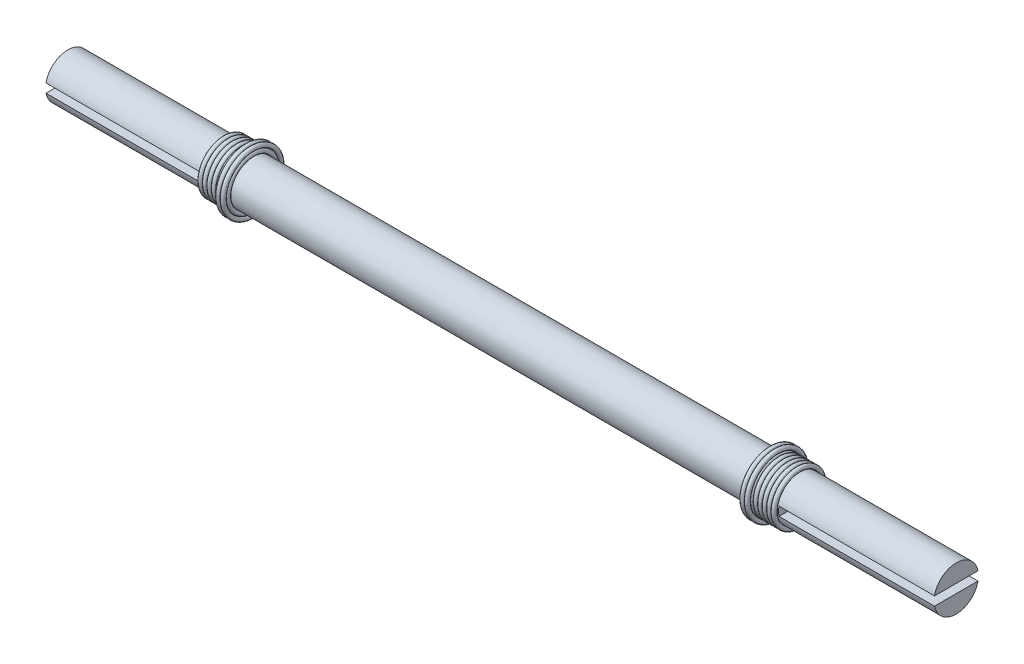
ISO-10303-21;
HEADER;
FILE_DESCRIPTION(('STEP AP214'),'2;1');
FILE_NAME('part.step','',(''),(''),'','','');
FILE_SCHEMA(('AUTOMOTIVE_DESIGN { 1 0 10303 214 1 1 1 1 }'));
ENDSEC;
DATA;
#1=APPLICATION_CONTEXT('core data for automotive mechanical design processes');
#2=APPLICATION_PROTOCOL_DEFINITION('international standard','automotive_design',2000,#1);
#3=PRODUCT_CONTEXT('',#1,'mechanical');
#4=PRODUCT('Part','Part','',(#3));
#5=PRODUCT_RELATED_PRODUCT_CATEGORY('part','',(#4));
#6=PRODUCT_DEFINITION_FORMATION('','',#4);
#7=PRODUCT_DEFINITION_CONTEXT('part definition',#1,'design');
#8=PRODUCT_DEFINITION('design','',#6,#7);
#9=PRODUCT_DEFINITION_SHAPE('','',#8);
#10=(LENGTH_UNIT() NAMED_UNIT(*) SI_UNIT(.MILLI.,.METRE.));
#11=(NAMED_UNIT(*) PLANE_ANGLE_UNIT() SI_UNIT($,.RADIAN.));
#12=(NAMED_UNIT(*) SI_UNIT($,.STERADIAN.) SOLID_ANGLE_UNIT());
#13=UNCERTAINTY_MEASURE_WITH_UNIT(LENGTH_MEASURE(1.E-05),#10,'distance_accuracy_value','');
#14=(GEOMETRIC_REPRESENTATION_CONTEXT(3) GLOBAL_UNCERTAINTY_ASSIGNED_CONTEXT((#13)) GLOBAL_UNIT_ASSIGNED_CONTEXT((#10,
#11,#12)) REPRESENTATION_CONTEXT('',''));
#15=CARTESIAN_POINT('',(0.,0.,0.));
#16=DIRECTION('',(0.,0.,1.));
#17=DIRECTION('',(1.,0.,0.));
#18=AXIS2_PLACEMENT_3D('',#15,#16,#17);
#19=CARTESIAN_POINT('',(100.,0.,0.));
#20=DIRECTION('',(1.,0.,0.));
#21=DIRECTION('',(0.,0.,-1.));
#22=AXIS2_PLACEMENT_3D('',#19,#20,#21);
#23=PLANE('',#22);
#24=DIRECTION('',(0.,0.,1.));
#25=VECTOR('',#24,1.);
#26=CARTESIAN_POINT('',(100.,1.,0.));
#27=LINE('',#26,#25);
#28=CARTESIAN_POINT('',(100.,0.999999999999973,-4.89897948556633));
#29=VERTEX_POINT('',#28);
#30=CARTESIAN_POINT('',(100.,1.,4.89897948556633));
#31=VERTEX_POINT('',#30);
#32=EDGE_CURVE('E176',#29,#31,#27,.T.);
#33=ORIENTED_EDGE('',*,*,#32,.F.);
#34=CARTESIAN_POINT('',(100.,0.,0.));
#35=DIRECTION('',(1.,0.,0.));
#36=DIRECTION('',(0.,0.,-1.));
#37=AXIS2_PLACEMENT_3D('',#34,#35,#36);
#38=CIRCLE('',#37,5.);
#39=EDGE_CURVE('E172',#29,#31,#38,.T.);
#40=ORIENTED_EDGE('',*,*,#39,.T.);
#41=EDGE_LOOP('',(#33,#40));
#42=FACE_BOUND('',#41,.T.);
#43=ADVANCED_FACE('F57',(#42),#23,.T.);
#44=CARTESIAN_POINT('',(100.,0.,0.));
#45=DIRECTION('',(-1.,0.,0.));
#46=DIRECTION('',(0.,0.,1.));
#47=AXIS2_PLACEMENT_3D('',#44,#45,#46);
#48=CYLINDRICAL_SURFACE('',#47,5.);
#49=ORIENTED_EDGE('',*,*,#39,.F.);
#50=DIRECTION('',(-1.,0.,0.));
#51=VECTOR('',#50,1.);
#52=CARTESIAN_POINT('',(100.,0.999999999999973,-4.89897948556633));
#53=LINE('',#52,#51);
#54=CARTESIAN_POINT('',(65.,0.999999999999973,-4.89897948556633));
#55=VERTEX_POINT('',#54);
#56=EDGE_CURVE('E168',#29,#55,#53,.T.);
#57=ORIENTED_EDGE('',*,*,#56,.T.);
#58=CARTESIAN_POINT('',(65.,0.,0.));
#59=DIRECTION('',(-1.,0.,0.));
#60=DIRECTION('',(0.,0.,1.));
#61=AXIS2_PLACEMENT_3D('',#58,#59,#60);
#62=CIRCLE('',#61,5.);
#63=CARTESIAN_POINT('',(65.,-1.,-4.89897948556639));
#64=VERTEX_POINT('',#63);
#65=EDGE_CURVE('E14',#55,#64,#62,.T.);
#66=ORIENTED_EDGE('',*,*,#65,.T.);
#67=DIRECTION('',(-1.,0.,0.));
#68=VECTOR('',#67,1.);
#69=CARTESIAN_POINT('',(100.,-1.,-4.89897948556639));
#70=LINE('',#69,#68);
#71=CARTESIAN_POINT('',(100.,-1.,-4.89897948556639));
#72=VERTEX_POINT('',#71);
#73=EDGE_CURVE('E163',#64,#72,#70,.F.);
#74=ORIENTED_EDGE('',*,*,#73,.T.);
#75=CARTESIAN_POINT('',(100.,-0.999999999999973,4.89897948556628));
#76=VERTEX_POINT('',#75);
#77=EDGE_CURVE('E171',#76,#72,#38,.T.);
#78=ORIENTED_EDGE('',*,*,#77,.F.);
#79=DIRECTION('',(-1.,0.,0.));
#80=VECTOR('',#79,1.);
#81=CARTESIAN_POINT('',(100.,-0.999999999999973,4.89897948556628));
#82=LINE('',#81,#80);
#83=CARTESIAN_POINT('',(65.,-0.999999999999973,4.89897948556628));
#84=VERTEX_POINT('',#83);
#85=EDGE_CURVE('E72',#76,#84,#82,.T.);
#86=ORIENTED_EDGE('',*,*,#85,.T.);
#87=CARTESIAN_POINT('',(65.,1.,4.89897948556633));
#88=VERTEX_POINT('',#87);
#89=EDGE_CURVE('E61',#84,#88,#62,.T.);
#90=ORIENTED_EDGE('',*,*,#89,.T.);
#91=DIRECTION('',(-1.,0.,0.));
#92=VECTOR('',#91,1.);
#93=CARTESIAN_POINT('',(100.,1.,4.89897948556633));
#94=LINE('',#93,#92);
#95=EDGE_CURVE('E80',#88,#31,#94,.F.);
#96=ORIENTED_EDGE('',*,*,#95,.T.);
#97=EDGE_LOOP('',(#49,#57,#66,#74,#78,#86,#90,#96));
#98=FACE_BOUND('',#97,.T.);
#99=CARTESIAN_POINT('',(-100.,0.,0.));
#100=DIRECTION('',(1.,0.,0.));
#101=DIRECTION('',(0.,0.,-1.));
#102=AXIS2_PLACEMENT_3D('',#99,#100,#101);
#103=CIRCLE('',#102,5.);
#104=CARTESIAN_POINT('',(-100.,0.999999999999973,-4.89897948556633));
#105=VERTEX_POINT('',#104);
#106=CARTESIAN_POINT('',(-100.,1.,4.89897948556633));
#107=VERTEX_POINT('',#106);
#108=EDGE_CURVE('E132',#105,#107,#103,.T.);
#109=ORIENTED_EDGE('',*,*,#108,.T.);
#110=DIRECTION('',(1.,0.,0.));
#111=VECTOR('',#110,1.);
#112=CARTESIAN_POINT('',(-100.,1.,4.89897948556633));
#113=LINE('',#112,#111);
#114=CARTESIAN_POINT('',(-65.,1.,4.89897948556633));
#115=VERTEX_POINT('',#114);
#116=EDGE_CURVE('E148',#115,#107,#113,.F.);
#117=ORIENTED_EDGE('',*,*,#116,.F.);
#118=CARTESIAN_POINT('',(-65.,0.,0.));
#119=DIRECTION('',(-1.,0.,0.));
#120=DIRECTION('',(0.,0.,1.));
#121=AXIS2_PLACEMENT_3D('',#118,#119,#120);
#122=CIRCLE('',#121,5.);
#123=CARTESIAN_POINT('',(-65.,-0.999999999999973,4.89897948556628));
#124=VERTEX_POINT('',#123);
#125=EDGE_CURVE('E154',#124,#115,#122,.T.);
#126=ORIENTED_EDGE('',*,*,#125,.F.);
#127=DIRECTION('',(1.,0.,0.));
#128=VECTOR('',#127,1.);
#129=CARTESIAN_POINT('',(-100.,-0.999999999999973,4.89897948556628));
#130=LINE('',#129,#128);
#131=CARTESIAN_POINT('',(-100.,-0.999999999999973,4.89897948556628));
#132=VERTEX_POINT('',#131);
#133=EDGE_CURVE('E141',#132,#124,#130,.T.);
#134=ORIENTED_EDGE('',*,*,#133,.F.);
#135=CARTESIAN_POINT('',(-100.,-1.,-4.89897948556639));
#136=VERTEX_POINT('',#135);
#137=EDGE_CURVE('E127',#132,#136,#103,.T.);
#138=ORIENTED_EDGE('',*,*,#137,.T.);
#139=DIRECTION('',(1.,0.,0.));
#140=VECTOR('',#139,1.);
#141=CARTESIAN_POINT('',(-100.,-1.,-4.89897948556639));
#142=LINE('',#141,#140);
#143=CARTESIAN_POINT('',(-65.,-1.,-4.89897948556639));
#144=VERTEX_POINT('',#143);
#145=EDGE_CURVE('E135',#144,#136,#142,.F.);
#146=ORIENTED_EDGE('',*,*,#145,.F.);
#147=CARTESIAN_POINT('',(-65.,0.999999999999973,-4.89897948556633));
#148=VERTEX_POINT('',#147);
#149=EDGE_CURVE('E157',#148,#144,#122,.T.);
#150=ORIENTED_EDGE('',*,*,#149,.F.);
#151=DIRECTION('',(1.,0.,0.));
#152=VECTOR('',#151,1.);
#153=CARTESIAN_POINT('',(-100.,0.999999999999973,-4.89897948556633));
#154=LINE('',#153,#152);
#155=EDGE_CURVE('E145',#105,#148,#154,.T.);
#156=ORIENTED_EDGE('',*,*,#155,.F.);
#157=EDGE_LOOP('',(#109,#117,#126,#134,#138,#146,#150,#156));
#158=FACE_BOUND('',#157,.T.);
#159=ADVANCED_FACE('F59',(#98,#158),#48,.T.);
#160=DIRECTION('',(0.,0.,-1.));
#161=VECTOR('',#160,1.);
#162=CARTESIAN_POINT('',(100.,-0.999999999999973,0.));
#163=LINE('',#162,#161);
#164=EDGE_CURVE('E175',#76,#72,#163,.T.);
#165=ORIENTED_EDGE('',*,*,#164,.F.);
#166=ORIENTED_EDGE('',*,*,#77,.T.);
#167=EDGE_LOOP('',(#165,#166));
#168=FACE_BOUND('',#167,.T.);
#169=ADVANCED_FACE('F187',(#168),#23,.T.);
#170=CARTESIAN_POINT('',(65.,0.,0.));
#171=DIRECTION('',(-1.,0.,0.));
#172=DIRECTION('',(0.,0.,1.));
#173=AXIS2_PLACEMENT_3D('',#170,#171,#172);
#174=PLANE('',#173);
#175=DIRECTION('',(0.,0.,1.));
#176=VECTOR('',#175,1.);
#177=CARTESIAN_POINT('',(65.,1.00000000000003,6.45567951505821));
#178=LINE('',#177,#176);
#179=EDGE_CURVE('E158',#55,#88,#178,.T.);
#180=ORIENTED_EDGE('',*,*,#179,.T.);
#181=ORIENTED_EDGE('',*,*,#89,.F.);
#182=DIRECTION('',(0.,0.,-1.));
#183=VECTOR('',#182,1.);
#184=CARTESIAN_POINT('',(65.,-1.,-7.22510667641657));
#185=LINE('',#184,#183);
#186=EDGE_CURVE('E160',#84,#64,#185,.T.);
#187=ORIENTED_EDGE('',*,*,#186,.T.);
#188=ORIENTED_EDGE('',*,*,#65,.F.);
#189=EDGE_LOOP('',(#180,#181,#187,#188));
#190=FACE_BOUND('',#189,.T.);
#191=ADVANCED_FACE('F183',(#190),#174,.F.);
#192=CARTESIAN_POINT('',(65.,1.,0.));
#193=DIRECTION('',(0.,1.,0.));
#194=DIRECTION('',(0.,0.,1.));
#195=AXIS2_PLACEMENT_3D('',#192,#193,#194);
#196=PLANE('',#195);
#197=ORIENTED_EDGE('',*,*,#32,.T.);
#198=ORIENTED_EDGE('',*,*,#95,.F.);
#199=ORIENTED_EDGE('',*,*,#179,.F.);
#200=ORIENTED_EDGE('',*,*,#56,.F.);
#201=EDGE_LOOP('',(#197,#198,#199,#200));
#202=FACE_BOUND('',#201,.T.);
#203=ADVANCED_FACE('F193',(#202),#196,.F.);
#204=CARTESIAN_POINT('',(65.,-1.,-7.22510667641657));
#205=DIRECTION('',(0.,-1.,0.));
#206=DIRECTION('',(0.,0.,-1.));
#207=AXIS2_PLACEMENT_3D('',#204,#205,#206);
#208=PLANE('',#207);
#209=ORIENTED_EDGE('',*,*,#164,.T.);
#210=ORIENTED_EDGE('',*,*,#73,.F.);
#211=ORIENTED_EDGE('',*,*,#186,.F.);
#212=ORIENTED_EDGE('',*,*,#85,.F.);
#213=EDGE_LOOP('',(#209,#210,#211,#212));
#214=FACE_BOUND('',#213,.T.);
#215=ADVANCED_FACE('F184',(#214),#208,.F.);
#216=CARTESIAN_POINT('',(-100.,0.,0.));
#217=DIRECTION('',(-1.,0.,0.));
#218=DIRECTION('',(0.,0.,-1.));
#219=AXIS2_PLACEMENT_3D('',#216,#217,#218);
#220=PLANE('',#219);
#221=DIRECTION('',(0.,0.,1.));
#222=VECTOR('',#221,1.);
#223=CARTESIAN_POINT('',(-100.,1.,0.));
#224=LINE('',#223,#222);
#225=EDGE_CURVE('E131',#105,#107,#224,.T.);
#226=ORIENTED_EDGE('',*,*,#225,.T.);
#227=ORIENTED_EDGE('',*,*,#108,.F.);
#228=EDGE_LOOP('',(#226,#227));
#229=FACE_BOUND('',#228,.T.);
#230=ADVANCED_FACE('F205',(#229),#220,.T.);
#231=DIRECTION('',(0.,0.,-1.));
#232=VECTOR('',#231,1.);
#233=CARTESIAN_POINT('',(-100.,-0.999999999999973,0.));
#234=LINE('',#233,#232);
#235=EDGE_CURVE('E123',#132,#136,#234,.T.);
#236=ORIENTED_EDGE('',*,*,#235,.T.);
#237=ORIENTED_EDGE('',*,*,#137,.F.);
#238=EDGE_LOOP('',(#236,#237));
#239=FACE_BOUND('',#238,.T.);
#240=ADVANCED_FACE('F125',(#239),#220,.T.);
#241=CARTESIAN_POINT('',(-65.,0.,0.));
#242=DIRECTION('',(1.,0.,0.));
#243=DIRECTION('',(0.,0.,1.));
#244=AXIS2_PLACEMENT_3D('',#241,#242,#243);
#245=PLANE('',#244);
#246=DIRECTION('',(0.,0.,1.));
#247=VECTOR('',#246,1.);
#248=CARTESIAN_POINT('',(-65.,1.00000000000003,6.45567951505821));
#249=LINE('',#248,#247);
#250=EDGE_CURVE('E220',#148,#115,#249,.T.);
#251=ORIENTED_EDGE('',*,*,#250,.F.);
#252=ORIENTED_EDGE('',*,*,#149,.T.);
#253=DIRECTION('',(0.,0.,-1.));
#254=VECTOR('',#253,1.);
#255=CARTESIAN_POINT('',(-65.,-1.,-7.22510667641657));
#256=LINE('',#255,#254);
#257=EDGE_CURVE('E137',#124,#144,#256,.T.);
#258=ORIENTED_EDGE('',*,*,#257,.F.);
#259=ORIENTED_EDGE('',*,*,#125,.T.);
#260=EDGE_LOOP('',(#251,#252,#258,#259));
#261=FACE_BOUND('',#260,.T.);
#262=ADVANCED_FACE('F209',(#261),#245,.F.);
#263=CARTESIAN_POINT('',(-65.,1.,0.));
#264=DIRECTION('',(0.,1.,0.));
#265=DIRECTION('',(0.,0.,1.));
#266=AXIS2_PLACEMENT_3D('',#263,#264,#265);
#267=PLANE('',#266);
#268=ORIENTED_EDGE('',*,*,#225,.F.);
#269=ORIENTED_EDGE('',*,*,#155,.T.);
#270=ORIENTED_EDGE('',*,*,#250,.T.);
#271=ORIENTED_EDGE('',*,*,#116,.T.);
#272=EDGE_LOOP('',(#268,#269,#270,#271));
#273=FACE_BOUND('',#272,.T.);
#274=ADVANCED_FACE('F212',(#273),#267,.F.);
#275=CARTESIAN_POINT('',(-65.,-1.,-7.22510667641657));
#276=DIRECTION('',(0.,-1.,0.));
#277=DIRECTION('',(0.,0.,-1.));
#278=AXIS2_PLACEMENT_3D('',#275,#276,#277);
#279=PLANE('',#278);
#280=ORIENTED_EDGE('',*,*,#235,.F.);
#281=ORIENTED_EDGE('',*,*,#133,.T.);
#282=ORIENTED_EDGE('',*,*,#257,.T.);
#283=ORIENTED_EDGE('',*,*,#145,.T.);
#284=EDGE_LOOP('',(#280,#281,#282,#283));
#285=FACE_BOUND('',#284,.T.);
#286=ADVANCED_FACE('F136',(#285),#279,.F.);
#287=CLOSED_SHELL('',(#43,#159,#169,#191,#203,#215,#230,#240,#262,#274,#286));
#288=MANIFOLD_SOLID_BREP('B2',#287);
#289=CARTESIAN_POINT('',(-58.5,0.,0.));
#290=DIRECTION('',(-1.,0.,0.));
#291=DIRECTION('',(0.,0.,-1.));
#292=AXIS2_PLACEMENT_3D('',#289,#290,#291);
#293=TOROIDAL_SURFACE('',#292,5.5,0.499999999999999);
#294=CARTESIAN_POINT('',(-58.5,5.49999999999998,0.));
#295=DIRECTION('',(0.,0.,-1.));
#296=DIRECTION('',(-1.,0.,0.));
#297=AXIS2_PLACEMENT_3D('',#294,#295,#296);
#298=CIRCLE('',#297,0.499999999999999);
#299=CARTESIAN_POINT('',(-58.5,6.,0.));
#300=VERTEX_POINT('',#299);
#301=EDGE_CURVE('E56',#300,#300,#298,.T.);
#302=CARTESIAN_POINT('',(-58.5,0.,0.));
#303=DIRECTION('',(-1.,0.,0.));
#304=DIRECTION('',(0.,0.,-1.));
#305=AXIS2_PLACEMENT_3D('',#302,#303,#304);
#306=CIRCLE('',#305,6.);
#307=EDGE_CURVE('',#300,#300,#306,.T.);
#308=ORIENTED_EDGE('',*,*,#301,.T.);
#309=ORIENTED_EDGE('',*,*,#301,.F.);
#310=ORIENTED_EDGE('',*,*,#307,.T.);
#311=ORIENTED_EDGE('',*,*,#307,.F.);
#312=EDGE_LOOP('',(#308,#310,#309,#311));
#313=FACE_BOUND('',#312,.T.);
#314=ADVANCED_FACE('F284',(#313),#293,.T.);
#315=OPEN_SHELL('',(#314));
#316=SHELL_BASED_SURFACE_MODEL('B8',(#315));
#317=CARTESIAN_POINT('',(-59.5,0.,0.));
#318=DIRECTION('',(-1.,0.,0.));
#319=DIRECTION('',(0.,0.,-1.));
#320=AXIS2_PLACEMENT_3D('',#317,#318,#319);
#321=TOROIDAL_SURFACE('',#320,6.5,0.499999999999999);
#322=CARTESIAN_POINT('',(-59.5,6.50000000000003,0.));
#323=DIRECTION('',(0.,0.,-1.));
#324=DIRECTION('',(-1.,0.,0.));
#325=AXIS2_PLACEMENT_3D('',#322,#323,#324);
#326=CIRCLE('',#325,0.499999999999999);
#327=CARTESIAN_POINT('',(-59.5,7.,0.));
#328=VERTEX_POINT('',#327);
#329=EDGE_CURVE('E283',#328,#328,#326,.T.);
#330=CARTESIAN_POINT('',(-59.5,0.,0.));
#331=DIRECTION('',(-1.,0.,0.));
#332=DIRECTION('',(0.,0.,-1.));
#333=AXIS2_PLACEMENT_3D('',#330,#331,#332);
#334=CIRCLE('',#333,7.);
#335=EDGE_CURVE('',#328,#328,#334,.T.);
#336=ORIENTED_EDGE('',*,*,#329,.T.);
#337=ORIENTED_EDGE('',*,*,#329,.F.);
#338=ORIENTED_EDGE('',*,*,#335,.T.);
#339=ORIENTED_EDGE('',*,*,#335,.F.);
#340=EDGE_LOOP('',(#336,#338,#337,#339));
#341=FACE_BOUND('',#340,.T.);
#342=ADVANCED_FACE('F307',(#341),#321,.T.);
#343=OPEN_SHELL('',(#342));
#344=SHELL_BASED_SURFACE_MODEL('B51',(#343));
#345=CARTESIAN_POINT('',(-58.5,0.,0.));
#346=DIRECTION('',(-1.,0.,0.));
#347=DIRECTION('',(0.,0.,-1.));
#348=AXIS2_PLACEMENT_3D('',#345,#346,#347);
#349=TOROIDAL_SURFACE('',#348,6.5,0.499999999999999);
#350=CARTESIAN_POINT('',(-58.5,6.50000000000003,0.));
#351=DIRECTION('',(0.,0.,-1.));
#352=DIRECTION('',(-1.,0.,0.));
#353=AXIS2_PLACEMENT_3D('',#350,#351,#352);
#354=CIRCLE('',#353,0.499999999999999);
#355=CARTESIAN_POINT('',(-58.5,7.,0.));
#356=VERTEX_POINT('',#355);
#357=EDGE_CURVE('E306',#356,#356,#354,.T.);
#358=CARTESIAN_POINT('',(-58.5,0.,0.));
#359=DIRECTION('',(-1.,0.,0.));
#360=DIRECTION('',(0.,0.,-1.));
#361=AXIS2_PLACEMENT_3D('',#358,#359,#360);
#362=CIRCLE('',#361,7.);
#363=EDGE_CURVE('',#356,#356,#362,.T.);
#364=ORIENTED_EDGE('',*,*,#357,.T.);
#365=ORIENTED_EDGE('',*,*,#357,.F.);
#366=ORIENTED_EDGE('',*,*,#363,.T.);
#367=ORIENTED_EDGE('',*,*,#363,.F.);
#368=EDGE_LOOP('',(#364,#366,#365,#367));
#369=FACE_BOUND('',#368,.T.);
#370=ADVANCED_FACE('F331',(#369),#349,.T.);
#371=OPEN_SHELL('',(#370));
#372=SHELL_BASED_SURFACE_MODEL('B278',(#371));
#373=CARTESIAN_POINT('',(-59.5,0.,0.));
#374=DIRECTION('',(-1.,0.,0.));
#375=DIRECTION('',(0.,0.,-1.));
#376=AXIS2_PLACEMENT_3D('',#373,#374,#375);
#377=TOROIDAL_SURFACE('',#376,5.5,0.499999999999999);
#378=CARTESIAN_POINT('',(-59.5,5.49999999999998,0.));
#379=DIRECTION('',(0.,0.,-1.));
#380=DIRECTION('',(-1.,0.,0.));
#381=AXIS2_PLACEMENT_3D('',#378,#379,#380);
#382=CIRCLE('',#381,0.499999999999999);
#383=CARTESIAN_POINT('',(-59.5,6.,0.));
#384=VERTEX_POINT('',#383);
#385=EDGE_CURVE('E330',#384,#384,#382,.T.);
#386=CARTESIAN_POINT('',(-59.5,0.,0.));
#387=DIRECTION('',(-1.,0.,0.));
#388=DIRECTION('',(0.,0.,-1.));
#389=AXIS2_PLACEMENT_3D('',#386,#387,#388);
#390=CIRCLE('',#389,6.);
#391=EDGE_CURVE('',#384,#384,#390,.T.);
#392=ORIENTED_EDGE('',*,*,#385,.T.);
#393=ORIENTED_EDGE('',*,*,#385,.F.);
#394=ORIENTED_EDGE('',*,*,#391,.T.);
#395=ORIENTED_EDGE('',*,*,#391,.F.);
#396=EDGE_LOOP('',(#392,#394,#393,#395));
#397=FACE_BOUND('',#396,.T.);
#398=ADVANCED_FACE('F354',(#397),#377,.T.);
#399=OPEN_SHELL('',(#398));
#400=SHELL_BASED_SURFACE_MODEL('B301',(#399));
#401=CARTESIAN_POINT('',(-60.5,0.,0.));
#402=DIRECTION('',(-1.,0.,0.));
#403=DIRECTION('',(0.,0.,-1.));
#404=AXIS2_PLACEMENT_3D('',#401,#402,#403);
#405=TOROIDAL_SURFACE('',#404,5.5,0.499999999999999);
#406=CARTESIAN_POINT('',(-60.5,5.49999999999998,0.));
#407=DIRECTION('',(0.,0.,-1.));
#408=DIRECTION('',(-1.,0.,0.));
#409=AXIS2_PLACEMENT_3D('',#406,#407,#408);
#410=CIRCLE('',#409,0.499999999999999);
#411=CARTESIAN_POINT('',(-60.5,6.,0.));
#412=VERTEX_POINT('',#411);
#413=EDGE_CURVE('E353',#412,#412,#410,.T.);
#414=CARTESIAN_POINT('',(-60.5,0.,0.));
#415=DIRECTION('',(-1.,0.,0.));
#416=DIRECTION('',(0.,0.,-1.));
#417=AXIS2_PLACEMENT_3D('',#414,#415,#416);
#418=CIRCLE('',#417,6.);
#419=EDGE_CURVE('',#412,#412,#418,.T.);
#420=ORIENTED_EDGE('',*,*,#413,.T.);
#421=ORIENTED_EDGE('',*,*,#413,.F.);
#422=ORIENTED_EDGE('',*,*,#419,.T.);
#423=ORIENTED_EDGE('',*,*,#419,.F.);
#424=EDGE_LOOP('',(#420,#422,#421,#423));
#425=FACE_BOUND('',#424,.T.);
#426=ADVANCED_FACE('F378',(#425),#405,.T.);
#427=OPEN_SHELL('',(#426));
#428=SHELL_BASED_SURFACE_MODEL('B325',(#427));
#429=CARTESIAN_POINT('',(-61.5,0.,0.));
#430=DIRECTION('',(-1.,0.,0.));
#431=DIRECTION('',(0.,0.,-1.));
#432=AXIS2_PLACEMENT_3D('',#429,#430,#431);
#433=TOROIDAL_SURFACE('',#432,5.5,0.499999999999999);
#434=CARTESIAN_POINT('',(-61.5,5.49999999999998,0.));
#435=DIRECTION('',(0.,0.,-1.));
#436=DIRECTION('',(-1.,0.,0.));
#437=AXIS2_PLACEMENT_3D('',#434,#435,#436);
#438=CIRCLE('',#437,0.499999999999999);
#439=CARTESIAN_POINT('',(-61.5,6.,0.));
#440=VERTEX_POINT('',#439);
#441=EDGE_CURVE('E377',#440,#440,#438,.T.);
#442=CARTESIAN_POINT('',(-61.5,0.,0.));
#443=DIRECTION('',(-1.,0.,0.));
#444=DIRECTION('',(0.,0.,-1.));
#445=AXIS2_PLACEMENT_3D('',#442,#443,#444);
#446=CIRCLE('',#445,6.);
#447=EDGE_CURVE('',#440,#440,#446,.T.);
#448=ORIENTED_EDGE('',*,*,#441,.T.);
#449=ORIENTED_EDGE('',*,*,#441,.F.);
#450=ORIENTED_EDGE('',*,*,#447,.T.);
#451=ORIENTED_EDGE('',*,*,#447,.F.);
#452=EDGE_LOOP('',(#448,#450,#449,#451));
#453=FACE_BOUND('',#452,.T.);
#454=ADVANCED_FACE('F402',(#453),#433,.T.);
#455=OPEN_SHELL('',(#454));
#456=SHELL_BASED_SURFACE_MODEL('B348',(#455));
#457=CARTESIAN_POINT('',(-62.5,0.,0.));
#458=DIRECTION('',(-1.,0.,0.));
#459=DIRECTION('',(0.,0.,-1.));
#460=AXIS2_PLACEMENT_3D('',#457,#458,#459);
#461=TOROIDAL_SURFACE('',#460,5.5,0.499999999999999);
#462=CARTESIAN_POINT('',(-62.5,5.49999999999998,0.));
#463=DIRECTION('',(0.,0.,-1.));
#464=DIRECTION('',(-1.,0.,0.));
#465=AXIS2_PLACEMENT_3D('',#462,#463,#464);
#466=CIRCLE('',#465,0.499999999999999);
#467=CARTESIAN_POINT('',(-62.5,6.,0.));
#468=VERTEX_POINT('',#467);
#469=EDGE_CURVE('E401',#468,#468,#466,.T.);
#470=CARTESIAN_POINT('',(-62.5,0.,0.));
#471=DIRECTION('',(-1.,0.,0.));
#472=DIRECTION('',(0.,0.,-1.));
#473=AXIS2_PLACEMENT_3D('',#470,#471,#472);
#474=CIRCLE('',#473,6.);
#475=EDGE_CURVE('',#468,#468,#474,.T.);
#476=ORIENTED_EDGE('',*,*,#469,.T.);
#477=ORIENTED_EDGE('',*,*,#469,.F.);
#478=ORIENTED_EDGE('',*,*,#475,.T.);
#479=ORIENTED_EDGE('',*,*,#475,.F.);
#480=EDGE_LOOP('',(#476,#478,#477,#479));
#481=FACE_BOUND('',#480,.T.);
#482=ADVANCED_FACE('F426',(#481),#461,.T.);
#483=OPEN_SHELL('',(#482));
#484=SHELL_BASED_SURFACE_MODEL('B372',(#483));
#485=CARTESIAN_POINT('',(-63.5,0.,0.));
#486=DIRECTION('',(-1.,0.,0.));
#487=DIRECTION('',(0.,0.,-1.));
#488=AXIS2_PLACEMENT_3D('',#485,#486,#487);
#489=TOROIDAL_SURFACE('',#488,5.5,0.499999999999999);
#490=CARTESIAN_POINT('',(-63.5,5.49999999999998,0.));
#491=DIRECTION('',(0.,0.,-1.));
#492=DIRECTION('',(-1.,0.,0.));
#493=AXIS2_PLACEMENT_3D('',#490,#491,#492);
#494=CIRCLE('',#493,0.499999999999999);
#495=CARTESIAN_POINT('',(-63.5,6.,0.));
#496=VERTEX_POINT('',#495);
#497=EDGE_CURVE('E425',#496,#496,#494,.T.);
#498=CARTESIAN_POINT('',(-63.5,0.,0.));
#499=DIRECTION('',(-1.,0.,0.));
#500=DIRECTION('',(0.,0.,-1.));
#501=AXIS2_PLACEMENT_3D('',#498,#499,#500);
#502=CIRCLE('',#501,6.);
#503=EDGE_CURVE('',#496,#496,#502,.T.);
#504=ORIENTED_EDGE('',*,*,#497,.T.);
#505=ORIENTED_EDGE('',*,*,#497,.F.);
#506=ORIENTED_EDGE('',*,*,#503,.T.);
#507=ORIENTED_EDGE('',*,*,#503,.F.);
#508=EDGE_LOOP('',(#504,#506,#505,#507));
#509=FACE_BOUND('',#508,.T.);
#510=ADVANCED_FACE('F450',(#509),#489,.T.);
#511=OPEN_SHELL('',(#510));
#512=SHELL_BASED_SURFACE_MODEL('B396',(#511));
#513=CARTESIAN_POINT('',(-64.5,0.,0.));
#514=DIRECTION('',(-1.,0.,0.));
#515=DIRECTION('',(0.,0.,-1.));
#516=AXIS2_PLACEMENT_3D('',#513,#514,#515);
#517=TOROIDAL_SURFACE('',#516,5.5,0.499999999999999);
#518=CARTESIAN_POINT('',(-64.5,5.49999999999998,0.));
#519=DIRECTION('',(0.,0.,-1.));
#520=DIRECTION('',(-1.,0.,0.));
#521=AXIS2_PLACEMENT_3D('',#518,#519,#520);
#522=CIRCLE('',#521,0.499999999999999);
#523=CARTESIAN_POINT('',(-64.5,6.,0.));
#524=VERTEX_POINT('',#523);
#525=EDGE_CURVE('E449',#524,#524,#522,.T.);
#526=CARTESIAN_POINT('',(-64.5,0.,0.));
#527=DIRECTION('',(-1.,0.,0.));
#528=DIRECTION('',(0.,0.,-1.));
#529=AXIS2_PLACEMENT_3D('',#526,#527,#528);
#530=CIRCLE('',#529,6.);
#531=EDGE_CURVE('',#524,#524,#530,.T.);
#532=ORIENTED_EDGE('',*,*,#525,.T.);
#533=ORIENTED_EDGE('',*,*,#525,.F.);
#534=ORIENTED_EDGE('',*,*,#531,.T.);
#535=ORIENTED_EDGE('',*,*,#531,.F.);
#536=EDGE_LOOP('',(#532,#534,#533,#535));
#537=FACE_BOUND('',#536,.T.);
#538=ADVANCED_FACE('F476',(#537),#517,.T.);
#539=OPEN_SHELL('',(#538));
#540=SHELL_BASED_SURFACE_MODEL('B420',(#539));
#541=CARTESIAN_POINT('',(59.5,0.,0.));
#542=DIRECTION('',(1.,0.,0.));
#543=DIRECTION('',(0.,0.,-1.));
#544=AXIS2_PLACEMENT_3D('',#541,#542,#543);
#545=TOROIDAL_SURFACE('',#544,6.5,0.499999999999999);
#546=CARTESIAN_POINT('',(59.5,6.50000000000003,0.));
#547=DIRECTION('',(0.,0.,1.));
#548=DIRECTION('',(1.,0.,0.));
#549=AXIS2_PLACEMENT_3D('',#546,#547,#548);
#550=CIRCLE('',#549,0.499999999999999);
#551=CARTESIAN_POINT('',(59.5,7.,0.));
#552=VERTEX_POINT('',#551);
#553=EDGE_CURVE('E475',#552,#552,#550,.T.);
#554=CARTESIAN_POINT('',(59.5,0.,0.));
#555=DIRECTION('',(1.,0.,0.));
#556=DIRECTION('',(0.,0.,-1.));
#557=AXIS2_PLACEMENT_3D('',#554,#555,#556);
#558=CIRCLE('',#557,7.);
#559=EDGE_CURVE('',#552,#552,#558,.T.);
#560=ORIENTED_EDGE('',*,*,#553,.T.);
#561=ORIENTED_EDGE('',*,*,#553,.F.);
#562=ORIENTED_EDGE('',*,*,#559,.T.);
#563=ORIENTED_EDGE('',*,*,#559,.F.);
#564=EDGE_LOOP('',(#560,#562,#561,#563));
#565=FACE_BOUND('',#564,.T.);
#566=ADVANCED_FACE('F508',(#565),#545,.T.);
#567=OPEN_SHELL('',(#566));
#568=SHELL_BASED_SURFACE_MODEL('B444',(#567));
#569=CARTESIAN_POINT('',(58.5,0.,0.));
#570=DIRECTION('',(1.,0.,0.));
#571=DIRECTION('',(0.,0.,-1.));
#572=AXIS2_PLACEMENT_3D('',#569,#570,#571);
#573=TOROIDAL_SURFACE('',#572,6.5,0.499999999999999);
#574=CARTESIAN_POINT('',(58.5,6.50000000000003,0.));
#575=DIRECTION('',(0.,0.,1.));
#576=DIRECTION('',(1.,0.,0.));
#577=AXIS2_PLACEMENT_3D('',#574,#575,#576);
#578=CIRCLE('',#577,0.499999999999999);
#579=CARTESIAN_POINT('',(58.5,7.,0.));
#580=VERTEX_POINT('',#579);
#581=EDGE_CURVE('E507',#580,#580,#578,.T.);
#582=CARTESIAN_POINT('',(58.5,0.,0.));
#583=DIRECTION('',(1.,0.,0.));
#584=DIRECTION('',(0.,0.,-1.));
#585=AXIS2_PLACEMENT_3D('',#582,#583,#584);
#586=CIRCLE('',#585,7.);
#587=EDGE_CURVE('',#580,#580,#586,.T.);
#588=ORIENTED_EDGE('',*,*,#581,.T.);
#589=ORIENTED_EDGE('',*,*,#581,.F.);
#590=ORIENTED_EDGE('',*,*,#587,.T.);
#591=ORIENTED_EDGE('',*,*,#587,.F.);
#592=EDGE_LOOP('',(#588,#590,#589,#591));
#593=FACE_BOUND('',#592,.T.);
#594=ADVANCED_FACE('F539',(#593),#573,.T.);
#595=OPEN_SHELL('',(#594));
#596=SHELL_BASED_SURFACE_MODEL('B470',(#595));
#597=CARTESIAN_POINT('',(64.5,0.,0.));
#598=DIRECTION('',(1.,0.,0.));
#599=DIRECTION('',(0.,0.,-1.));
#600=AXIS2_PLACEMENT_3D('',#597,#598,#599);
#601=TOROIDAL_SURFACE('',#600,5.5,0.499999999999999);
#602=CARTESIAN_POINT('',(64.5,5.49999999999998,0.));
#603=DIRECTION('',(0.,0.,1.));
#604=DIRECTION('',(1.,0.,0.));
#605=AXIS2_PLACEMENT_3D('',#602,#603,#604);
#606=CIRCLE('',#605,0.499999999999999);
#607=CARTESIAN_POINT('',(64.5,6.,0.));
#608=VERTEX_POINT('',#607);
#609=EDGE_CURVE('E538',#608,#608,#606,.T.);
#610=CARTESIAN_POINT('',(64.5,0.,0.));
#611=DIRECTION('',(1.,0.,0.));
#612=DIRECTION('',(0.,0.,-1.));
#613=AXIS2_PLACEMENT_3D('',#610,#611,#612);
#614=CIRCLE('',#613,6.);
#615=EDGE_CURVE('',#608,#608,#614,.T.);
#616=ORIENTED_EDGE('',*,*,#609,.T.);
#617=ORIENTED_EDGE('',*,*,#609,.F.);
#618=ORIENTED_EDGE('',*,*,#615,.T.);
#619=ORIENTED_EDGE('',*,*,#615,.F.);
#620=EDGE_LOOP('',(#616,#618,#617,#619));
#621=FACE_BOUND('',#620,.T.);
#622=ADVANCED_FACE('F569',(#621),#601,.T.);
#623=OPEN_SHELL('',(#622));
#624=SHELL_BASED_SURFACE_MODEL('B502',(#623));
#625=CARTESIAN_POINT('',(63.5,0.,0.));
#626=DIRECTION('',(1.,0.,0.));
#627=DIRECTION('',(0.,0.,-1.));
#628=AXIS2_PLACEMENT_3D('',#625,#626,#627);
#629=TOROIDAL_SURFACE('',#628,5.5,0.499999999999999);
#630=CARTESIAN_POINT('',(63.5,5.49999999999998,0.));
#631=DIRECTION('',(0.,0.,1.));
#632=DIRECTION('',(1.,0.,0.));
#633=AXIS2_PLACEMENT_3D('',#630,#631,#632);
#634=CIRCLE('',#633,0.499999999999999);
#635=CARTESIAN_POINT('',(63.5,6.,0.));
#636=VERTEX_POINT('',#635);
#637=EDGE_CURVE('E568',#636,#636,#634,.T.);
#638=CARTESIAN_POINT('',(63.5,0.,0.));
#639=DIRECTION('',(1.,0.,0.));
#640=DIRECTION('',(0.,0.,-1.));
#641=AXIS2_PLACEMENT_3D('',#638,#639,#640);
#642=CIRCLE('',#641,6.);
#643=EDGE_CURVE('',#636,#636,#642,.T.);
#644=ORIENTED_EDGE('',*,*,#637,.T.);
#645=ORIENTED_EDGE('',*,*,#637,.F.);
#646=ORIENTED_EDGE('',*,*,#643,.T.);
#647=ORIENTED_EDGE('',*,*,#643,.F.);
#648=EDGE_LOOP('',(#644,#646,#645,#647));
#649=FACE_BOUND('',#648,.T.);
#650=ADVANCED_FACE('F598',(#649),#629,.T.);
#651=OPEN_SHELL('',(#650));
#652=SHELL_BASED_SURFACE_MODEL('B533',(#651));
#653=CARTESIAN_POINT('',(62.5,0.,0.));
#654=DIRECTION('',(1.,0.,0.));
#655=DIRECTION('',(0.,0.,-1.));
#656=AXIS2_PLACEMENT_3D('',#653,#654,#655);
#657=TOROIDAL_SURFACE('',#656,5.5,0.499999999999999);
#658=CARTESIAN_POINT('',(62.5,5.49999999999998,0.));
#659=DIRECTION('',(0.,0.,1.));
#660=DIRECTION('',(1.,0.,0.));
#661=AXIS2_PLACEMENT_3D('',#658,#659,#660);
#662=CIRCLE('',#661,0.499999999999999);
#663=CARTESIAN_POINT('',(62.5,6.,0.));
#664=VERTEX_POINT('',#663);
#665=EDGE_CURVE('E597',#664,#664,#662,.T.);
#666=CARTESIAN_POINT('',(62.5,0.,0.));
#667=DIRECTION('',(1.,0.,0.));
#668=DIRECTION('',(0.,0.,-1.));
#669=AXIS2_PLACEMENT_3D('',#666,#667,#668);
#670=CIRCLE('',#669,6.);
#671=EDGE_CURVE('',#664,#664,#670,.T.);
#672=ORIENTED_EDGE('',*,*,#665,.T.);
#673=ORIENTED_EDGE('',*,*,#665,.F.);
#674=ORIENTED_EDGE('',*,*,#671,.T.);
#675=ORIENTED_EDGE('',*,*,#671,.F.);
#676=EDGE_LOOP('',(#672,#674,#673,#675));
#677=FACE_BOUND('',#676,.T.);
#678=ADVANCED_FACE('F621',(#677),#657,.T.);
#679=OPEN_SHELL('',(#678));
#680=SHELL_BASED_SURFACE_MODEL('B563',(#679));
#681=CARTESIAN_POINT('',(61.5,0.,0.));
#682=DIRECTION('',(1.,0.,0.));
#683=DIRECTION('',(0.,0.,-1.));
#684=AXIS2_PLACEMENT_3D('',#681,#682,#683);
#685=TOROIDAL_SURFACE('',#684,5.5,0.499999999999999);
#686=CARTESIAN_POINT('',(61.5,5.49999999999998,0.));
#687=DIRECTION('',(0.,0.,1.));
#688=DIRECTION('',(1.,0.,0.));
#689=AXIS2_PLACEMENT_3D('',#686,#687,#688);
#690=CIRCLE('',#689,0.499999999999999);
#691=CARTESIAN_POINT('',(61.5,6.,0.));
#692=VERTEX_POINT('',#691);
#693=EDGE_CURVE('E620',#692,#692,#690,.T.);
#694=CARTESIAN_POINT('',(61.5,0.,0.));
#695=DIRECTION('',(1.,0.,0.));
#696=DIRECTION('',(0.,0.,-1.));
#697=AXIS2_PLACEMENT_3D('',#694,#695,#696);
#698=CIRCLE('',#697,6.);
#699=EDGE_CURVE('',#692,#692,#698,.T.);
#700=ORIENTED_EDGE('',*,*,#693,.T.);
#701=ORIENTED_EDGE('',*,*,#693,.F.);
#702=ORIENTED_EDGE('',*,*,#699,.T.);
#703=ORIENTED_EDGE('',*,*,#699,.F.);
#704=EDGE_LOOP('',(#700,#702,#701,#703));
#705=FACE_BOUND('',#704,.T.);
#706=ADVANCED_FACE('F644',(#705),#685,.T.);
#707=OPEN_SHELL('',(#706));
#708=SHELL_BASED_SURFACE_MODEL('B592',(#707));
#709=CARTESIAN_POINT('',(60.5,0.,0.));
#710=DIRECTION('',(1.,0.,0.));
#711=DIRECTION('',(0.,0.,-1.));
#712=AXIS2_PLACEMENT_3D('',#709,#710,#711);
#713=TOROIDAL_SURFACE('',#712,5.5,0.499999999999999);
#714=CARTESIAN_POINT('',(60.5,5.49999999999998,0.));
#715=DIRECTION('',(0.,0.,1.));
#716=DIRECTION('',(1.,0.,0.));
#717=AXIS2_PLACEMENT_3D('',#714,#715,#716);
#718=CIRCLE('',#717,0.499999999999999);
#719=CARTESIAN_POINT('',(60.5,6.,0.));
#720=VERTEX_POINT('',#719);
#721=EDGE_CURVE('E643',#720,#720,#718,.T.);
#722=CARTESIAN_POINT('',(60.5,0.,0.));
#723=DIRECTION('',(1.,0.,0.));
#724=DIRECTION('',(0.,0.,-1.));
#725=AXIS2_PLACEMENT_3D('',#722,#723,#724);
#726=CIRCLE('',#725,6.);
#727=EDGE_CURVE('',#720,#720,#726,.T.);
#728=ORIENTED_EDGE('',*,*,#721,.T.);
#729=ORIENTED_EDGE('',*,*,#721,.F.);
#730=ORIENTED_EDGE('',*,*,#727,.T.);
#731=ORIENTED_EDGE('',*,*,#727,.F.);
#732=EDGE_LOOP('',(#728,#730,#729,#731));
#733=FACE_BOUND('',#732,.T.);
#734=ADVANCED_FACE('F669',(#733),#713,.T.);
#735=OPEN_SHELL('',(#734));
#736=SHELL_BASED_SURFACE_MODEL('B615',(#735));
#737=CARTESIAN_POINT('',(59.5,0.,0.));
#738=DIRECTION('',(1.,0.,0.));
#739=DIRECTION('',(0.,0.,-1.));
#740=AXIS2_PLACEMENT_3D('',#737,#738,#739);
#741=TOROIDAL_SURFACE('',#740,5.5,0.499999999999999);
#742=CARTESIAN_POINT('',(59.5,5.49999999999998,0.));
#743=DIRECTION('',(0.,0.,1.));
#744=DIRECTION('',(1.,0.,0.));
#745=AXIS2_PLACEMENT_3D('',#742,#743,#744);
#746=CIRCLE('',#745,0.499999999999999);
#747=CARTESIAN_POINT('',(59.5,6.,0.));
#748=VERTEX_POINT('',#747);
#749=EDGE_CURVE('E668',#748,#748,#746,.T.);
#750=CARTESIAN_POINT('',(59.5,0.,0.));
#751=DIRECTION('',(1.,0.,0.));
#752=DIRECTION('',(0.,0.,-1.));
#753=AXIS2_PLACEMENT_3D('',#750,#751,#752);
#754=CIRCLE('',#753,6.);
#755=EDGE_CURVE('',#748,#748,#754,.T.);
#756=ORIENTED_EDGE('',*,*,#749,.T.);
#757=ORIENTED_EDGE('',*,*,#749,.F.);
#758=ORIENTED_EDGE('',*,*,#755,.T.);
#759=ORIENTED_EDGE('',*,*,#755,.F.);
#760=EDGE_LOOP('',(#756,#758,#757,#759));
#761=FACE_BOUND('',#760,.T.);
#762=ADVANCED_FACE('F699',(#761),#741,.T.);
#763=OPEN_SHELL('',(#762));
#764=SHELL_BASED_SURFACE_MODEL('B638',(#763));
#765=CARTESIAN_POINT('',(58.5,0.,0.));
#766=DIRECTION('',(1.,0.,0.));
#767=DIRECTION('',(0.,0.,-1.));
#768=AXIS2_PLACEMENT_3D('',#765,#766,#767);
#769=TOROIDAL_SURFACE('',#768,5.5,0.499999999999999);
#770=CARTESIAN_POINT('',(58.5,5.49999999999998,0.));
#771=DIRECTION('',(0.,0.,1.));
#772=DIRECTION('',(1.,0.,0.));
#773=AXIS2_PLACEMENT_3D('',#770,#771,#772);
#774=CIRCLE('',#773,0.499999999999999);
#775=CARTESIAN_POINT('',(58.5,6.,0.));
#776=VERTEX_POINT('',#775);
#777=EDGE_CURVE('E698',#776,#776,#774,.T.);
#778=CARTESIAN_POINT('',(58.5,0.,0.));
#779=DIRECTION('',(1.,0.,0.));
#780=DIRECTION('',(0.,0.,-1.));
#781=AXIS2_PLACEMENT_3D('',#778,#779,#780);
#782=CIRCLE('',#781,6.);
#783=EDGE_CURVE('',#776,#776,#782,.T.);
#784=ORIENTED_EDGE('',*,*,#777,.T.);
#785=ORIENTED_EDGE('',*,*,#777,.F.);
#786=ORIENTED_EDGE('',*,*,#783,.T.);
#787=ORIENTED_EDGE('',*,*,#783,.F.);
#788=EDGE_LOOP('',(#784,#786,#785,#787));
#789=FACE_BOUND('',#788,.T.);
#790=ADVANCED_FACE('F720',(#789),#769,.T.);
#791=OPEN_SHELL('',(#790));
#792=SHELL_BASED_SURFACE_MODEL('B663',(#791));
#793=ADVANCED_BREP_SHAPE_REPRESENTATION('',(#18,#288),#14);
#794=MANIFOLD_SURFACE_SHAPE_REPRESENTATION('',(#18,#316,#344,#372,#400,#428,#456,#484,#512,#540,
#568,#596,#624,#652,#680,#708,#736,#764,#792),#14);
#795=SHAPE_REPRESENTATION('',(#18),#14);
#796=SHAPE_DEFINITION_REPRESENTATION(#9,#795);
#797=SHAPE_REPRESENTATION_RELATIONSHIP('','',#795,#793);
#798=SHAPE_REPRESENTATION_RELATIONSHIP('','',#795,#794);
ENDSEC;
END-ISO-10303-21;
